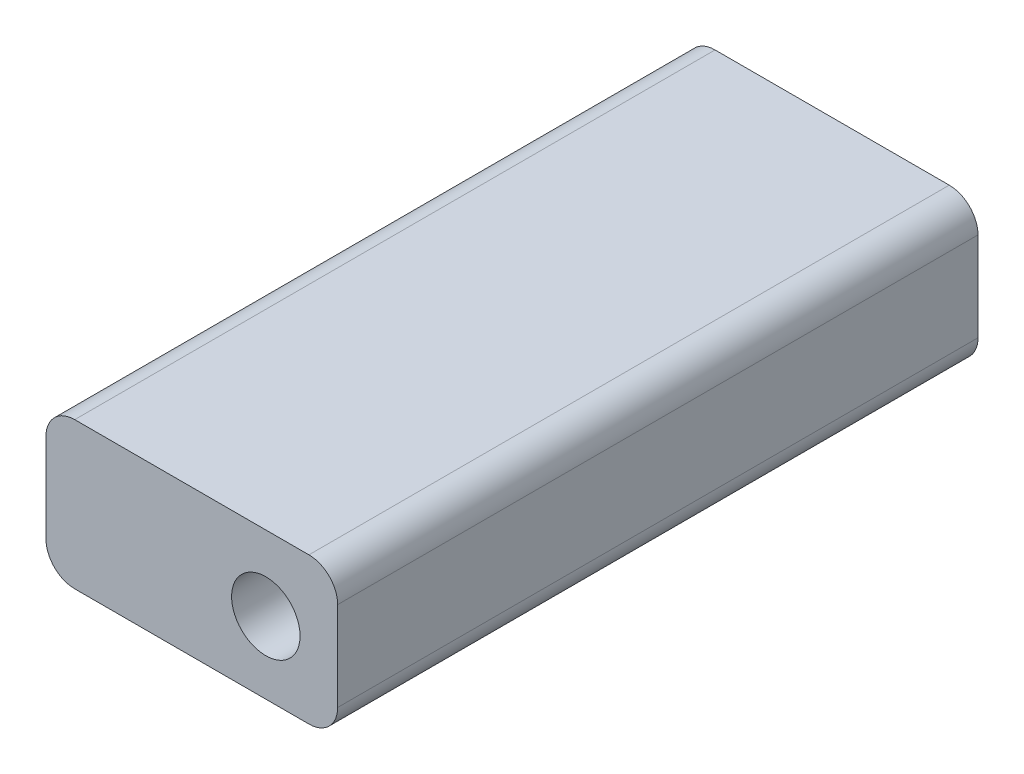
ISO-10303-21;
HEADER;
FILE_DESCRIPTION(('STEP AP214'),'2;1');
FILE_NAME('part.step','',(''),(''),'','','');
FILE_SCHEMA(('AUTOMOTIVE_DESIGN { 1 0 10303 214 1 1 1 1 }'));
ENDSEC;
DATA;
#1=APPLICATION_CONTEXT('core data for automotive mechanical design processes');
#2=APPLICATION_PROTOCOL_DEFINITION('international standard','automotive_design',2000,#1);
#3=PRODUCT_CONTEXT('',#1,'mechanical');
#4=PRODUCT('Part','Part','',(#3));
#5=PRODUCT_RELATED_PRODUCT_CATEGORY('part','',(#4));
#6=PRODUCT_DEFINITION_FORMATION('','',#4);
#7=PRODUCT_DEFINITION_CONTEXT('part definition',#1,'design');
#8=PRODUCT_DEFINITION('design','',#6,#7);
#9=PRODUCT_DEFINITION_SHAPE('','',#8);
#10=(LENGTH_UNIT() NAMED_UNIT(*) SI_UNIT(.MILLI.,.METRE.));
#11=(NAMED_UNIT(*) PLANE_ANGLE_UNIT() SI_UNIT($,.RADIAN.));
#12=(NAMED_UNIT(*) SI_UNIT($,.STERADIAN.) SOLID_ANGLE_UNIT());
#13=UNCERTAINTY_MEASURE_WITH_UNIT(LENGTH_MEASURE(1.E-05),#10,'distance_accuracy_value','');
#14=(GEOMETRIC_REPRESENTATION_CONTEXT(3) GLOBAL_UNCERTAINTY_ASSIGNED_CONTEXT((#13)) GLOBAL_UNIT_ASSIGNED_CONTEXT((#10,
#11,#12)) REPRESENTATION_CONTEXT('',''));
#15=CARTESIAN_POINT('',(0.,0.,0.));
#16=DIRECTION('',(0.,0.,1.));
#17=DIRECTION('',(1.,0.,0.));
#18=AXIS2_PLACEMENT_3D('',#15,#16,#17);
#19=CARTESIAN_POINT('',(0.,0.,56.59882));
#20=DIRECTION('',(0.,0.,1.));
#21=DIRECTION('',(1.,0.,0.));
#22=AXIS2_PLACEMENT_3D('',#19,#20,#21);
#23=PLANE('',#22);
#24=DIRECTION('',(-1.,0.,0.));
#25=VECTOR('',#24,1.);
#26=CARTESIAN_POINT('',(-19.4300000020002,91.526,56.59882));
#27=LINE('',#26,#25);
#28=CARTESIAN_POINT('',(3.80999999999999,91.526,56.59882));
#29=VERTEX_POINT('',#28);
#30=CARTESIAN_POINT('',(-16.8900000020002,91.526,56.59882));
#31=VERTEX_POINT('',#30);
#32=EDGE_CURVE('E140',#29,#31,#27,.T.);
#33=ORIENTED_EDGE('',*,*,#32,.T.);
#34=CARTESIAN_POINT('',(-16.8900000020002,88.986,56.59882));
#35=DIRECTION('',(0.,0.,1.));
#36=DIRECTION('',(1.,0.,0.));
#37=AXIS2_PLACEMENT_3D('',#34,#35,#36);
#38=CIRCLE('',#37,2.54);
#39=CARTESIAN_POINT('',(-19.4300000020002,88.986,56.59882));
#40=VERTEX_POINT('',#39);
#41=EDGE_CURVE('E159',#31,#40,#38,.T.);
#42=ORIENTED_EDGE('',*,*,#41,.T.);
#43=DIRECTION('',(0.,-1.,0.));
#44=VECTOR('',#43,1.);
#45=CARTESIAN_POINT('',(-19.4300000020002,91.526,56.59882));
#46=LINE('',#45,#44);
#47=CARTESIAN_POINT('',(-19.4300000020002,81.1119734157718,56.59882));
#48=VERTEX_POINT('',#47);
#49=EDGE_CURVE('E123',#40,#48,#46,.T.);
#50=ORIENTED_EDGE('',*,*,#49,.T.);
#51=CARTESIAN_POINT('',(-16.8900000020002,81.1119734157718,56.59882));
#52=DIRECTION('',(0.,0.,1.));
#53=DIRECTION('',(1.,0.,0.));
#54=AXIS2_PLACEMENT_3D('',#51,#52,#53);
#55=CIRCLE('',#54,2.54);
#56=CARTESIAN_POINT('',(-16.8900000020002,78.5719734157718,56.59882));
#57=VERTEX_POINT('',#56);
#58=EDGE_CURVE('E154',#48,#57,#55,.T.);
#59=ORIENTED_EDGE('',*,*,#58,.T.);
#60=DIRECTION('',(1.,0.,0.));
#61=VECTOR('',#60,1.);
#62=CARTESIAN_POINT('',(-19.4300000020002,78.5719734157718,56.59882));
#63=LINE('',#62,#61);
#64=CARTESIAN_POINT('',(3.80999999999999,78.5719734157718,56.59882));
#65=VERTEX_POINT('',#64);
#66=EDGE_CURVE('E170',#57,#65,#63,.T.);
#67=ORIENTED_EDGE('',*,*,#66,.T.);
#68=CARTESIAN_POINT('',(3.81,81.1119734157718,56.59882));
#69=DIRECTION('',(0.,0.,1.));
#70=DIRECTION('',(1.,0.,0.));
#71=AXIS2_PLACEMENT_3D('',#68,#69,#70);
#72=CIRCLE('',#71,2.54);
#73=CARTESIAN_POINT('',(6.35,81.1119734157718,56.59882));
#74=VERTEX_POINT('',#73);
#75=EDGE_CURVE('E59',#65,#74,#72,.T.);
#76=ORIENTED_EDGE('',*,*,#75,.T.);
#77=DIRECTION('',(0.,1.,0.));
#78=VECTOR('',#77,1.);
#79=CARTESIAN_POINT('',(6.35,91.526,56.59882));
#80=LINE('',#79,#78);
#81=CARTESIAN_POINT('',(6.35,88.986,56.59882));
#82=VERTEX_POINT('',#81);
#83=EDGE_CURVE('E178',#74,#82,#80,.T.);
#84=ORIENTED_EDGE('',*,*,#83,.T.);
#85=CARTESIAN_POINT('',(3.81,88.986,56.59882));
#86=DIRECTION('',(0.,0.,1.));
#87=DIRECTION('',(1.,0.,0.));
#88=AXIS2_PLACEMENT_3D('',#85,#86,#87);
#89=CIRCLE('',#88,2.54);
#90=EDGE_CURVE('E157',#82,#29,#89,.T.);
#91=ORIENTED_EDGE('',*,*,#90,.T.);
#92=EDGE_LOOP('',(#33,#42,#50,#59,#67,#76,#84,#91));
#93=FACE_BOUND('',#92,.T.);
#94=CARTESIAN_POINT('',(0.,84.9219734157718,56.59882));
#95=DIRECTION('',(0.,0.,1.));
#96=DIRECTION('',(1.,0.,0.));
#97=AXIS2_PLACEMENT_3D('',#94,#95,#96);
#98=CIRCLE('',#97,3.025);
#99=CARTESIAN_POINT('',(3.025,84.9219734157718,56.59882));
#100=VERTEX_POINT('',#99);
#101=EDGE_CURVE('E131',#100,#100,#98,.T.);
#102=ORIENTED_EDGE('',*,*,#101,.F.);
#103=EDGE_LOOP('',(#102));
#104=FACE_BOUND('',#103,.T.);
#105=ADVANCED_FACE('F37',(#93,#104),#23,.T.);
#106=CARTESIAN_POINT('',(0.,0.,0.));
#107=DIRECTION('',(0.,0.,1.));
#108=DIRECTION('',(1.,0.,0.));
#109=AXIS2_PLACEMENT_3D('',#106,#107,#108);
#110=PLANE('',#109);
#111=DIRECTION('',(0.,-1.,0.));
#112=VECTOR('',#111,1.);
#113=CARTESIAN_POINT('',(-19.4300000020002,91.526,0.));
#114=LINE('',#113,#112);
#115=CARTESIAN_POINT('',(-19.4300000020002,88.986,0.));
#116=VERTEX_POINT('',#115);
#117=CARTESIAN_POINT('',(-19.4300000020002,81.1119734157718,0.));
#118=VERTEX_POINT('',#117);
#119=EDGE_CURVE('E120',#116,#118,#114,.T.);
#120=ORIENTED_EDGE('',*,*,#119,.F.);
#121=CARTESIAN_POINT('',(-16.8900000020002,88.986,0.));
#122=DIRECTION('',(0.,0.,1.));
#123=DIRECTION('',(1.,0.,0.));
#124=AXIS2_PLACEMENT_3D('',#121,#122,#123);
#125=CIRCLE('',#124,2.54);
#126=CARTESIAN_POINT('',(-16.8900000020002,91.526,0.));
#127=VERTEX_POINT('',#126);
#128=EDGE_CURVE('E103',#116,#127,#125,.F.);
#129=ORIENTED_EDGE('',*,*,#128,.T.);
#130=DIRECTION('',(-1.,0.,0.));
#131=VECTOR('',#130,1.);
#132=CARTESIAN_POINT('',(-19.4300000020002,91.526,0.));
#133=LINE('',#132,#131);
#134=CARTESIAN_POINT('',(3.80999999999999,91.526,0.));
#135=VERTEX_POINT('',#134);
#136=EDGE_CURVE('E144',#135,#127,#133,.T.);
#137=ORIENTED_EDGE('',*,*,#136,.F.);
#138=CARTESIAN_POINT('',(3.81,88.986,0.));
#139=DIRECTION('',(0.,0.,1.));
#140=DIRECTION('',(1.,0.,0.));
#141=AXIS2_PLACEMENT_3D('',#138,#139,#140);
#142=CIRCLE('',#141,2.54);
#143=CARTESIAN_POINT('',(6.35,88.986,0.));
#144=VERTEX_POINT('',#143);
#145=EDGE_CURVE('E114',#135,#144,#142,.F.);
#146=ORIENTED_EDGE('',*,*,#145,.T.);
#147=DIRECTION('',(0.,1.,0.));
#148=VECTOR('',#147,1.);
#149=CARTESIAN_POINT('',(6.35,91.526,0.));
#150=LINE('',#149,#148);
#151=CARTESIAN_POINT('',(6.35,81.1119734157718,0.));
#152=VERTEX_POINT('',#151);
#153=EDGE_CURVE('E134',#152,#144,#150,.T.);
#154=ORIENTED_EDGE('',*,*,#153,.F.);
#155=CARTESIAN_POINT('',(3.81,81.1119734157718,0.));
#156=DIRECTION('',(0.,0.,1.));
#157=DIRECTION('',(1.,0.,0.));
#158=AXIS2_PLACEMENT_3D('',#155,#156,#157);
#159=CIRCLE('',#158,2.54);
#160=CARTESIAN_POINT('',(3.80999999999999,78.5719734157718,0.));
#161=VERTEX_POINT('',#160);
#162=EDGE_CURVE('E148',#152,#161,#159,.F.);
#163=ORIENTED_EDGE('',*,*,#162,.T.);
#164=DIRECTION('',(1.,0.,0.));
#165=VECTOR('',#164,1.);
#166=CARTESIAN_POINT('',(-19.4300000020002,78.5719734157718,0.));
#167=LINE('',#166,#165);
#168=CARTESIAN_POINT('',(-16.8900000020002,78.5719734157718,0.));
#169=VERTEX_POINT('',#168);
#170=EDGE_CURVE('E130',#169,#161,#167,.T.);
#171=ORIENTED_EDGE('',*,*,#170,.F.);
#172=CARTESIAN_POINT('',(-16.8900000020002,81.1119734157718,0.));
#173=DIRECTION('',(0.,0.,1.));
#174=DIRECTION('',(1.,0.,0.));
#175=AXIS2_PLACEMENT_3D('',#172,#173,#174);
#176=CIRCLE('',#175,2.54);
#177=EDGE_CURVE('E124',#169,#118,#176,.F.);
#178=ORIENTED_EDGE('',*,*,#177,.T.);
#179=EDGE_LOOP('',(#120,#129,#137,#146,#154,#163,#171,#178));
#180=FACE_BOUND('',#179,.T.);
#181=CARTESIAN_POINT('',(0.,84.9219734157718,0.));
#182=DIRECTION('',(0.,0.,1.));
#183=DIRECTION('',(1.,0.,0.));
#184=AXIS2_PLACEMENT_3D('',#181,#182,#183);
#185=CIRCLE('',#184,3.025);
#186=CARTESIAN_POINT('',(3.025,84.9219734157718,0.));
#187=VERTEX_POINT('',#186);
#188=EDGE_CURVE('E137',#187,#187,#185,.T.);
#189=ORIENTED_EDGE('',*,*,#188,.T.);
#190=EDGE_LOOP('',(#189));
#191=FACE_BOUND('',#190,.T.);
#192=ADVANCED_FACE('F127',(#180,#191),#110,.F.);
#193=CARTESIAN_POINT('',(-19.4300000020002,91.526,56.59882));
#194=DIRECTION('',(1.,0.,0.));
#195=DIRECTION('',(0.,0.,-1.));
#196=AXIS2_PLACEMENT_3D('',#193,#194,#195);
#197=PLANE('',#196);
#198=ORIENTED_EDGE('',*,*,#49,.F.);
#199=DIRECTION('',(0.,0.,-1.));
#200=VECTOR('',#199,1.);
#201=CARTESIAN_POINT('',(-19.4300000020002,88.986,56.59882));
#202=LINE('',#201,#200);
#203=EDGE_CURVE('E107',#40,#116,#202,.T.);
#204=ORIENTED_EDGE('',*,*,#203,.T.);
#205=ORIENTED_EDGE('',*,*,#119,.T.);
#206=DIRECTION('',(0.,0.,-1.));
#207=VECTOR('',#206,1.);
#208=CARTESIAN_POINT('',(-19.4300000020002,81.1119734157718,56.59882));
#209=LINE('',#208,#207);
#210=EDGE_CURVE('E125',#118,#48,#209,.F.);
#211=ORIENTED_EDGE('',*,*,#210,.T.);
#212=EDGE_LOOP('',(#198,#204,#205,#211));
#213=FACE_BOUND('',#212,.T.);
#214=ADVANCED_FACE('F119',(#213),#197,.F.);
#215=CARTESIAN_POINT('',(-19.4300000020002,78.5719734157718,56.59882));
#216=DIRECTION('',(0.,1.,0.));
#217=DIRECTION('',(0.,0.,1.));
#218=AXIS2_PLACEMENT_3D('',#215,#216,#217);
#219=PLANE('',#218);
#220=ORIENTED_EDGE('',*,*,#170,.T.);
#221=DIRECTION('',(0.,0.,-1.));
#222=VECTOR('',#221,1.);
#223=CARTESIAN_POINT('',(3.81,78.5719734157718,56.59882));
#224=LINE('',#223,#222);
#225=EDGE_CURVE('E11',#161,#65,#224,.F.);
#226=ORIENTED_EDGE('',*,*,#225,.T.);
#227=ORIENTED_EDGE('',*,*,#66,.F.);
#228=DIRECTION('',(0.,0.,-1.));
#229=VECTOR('',#228,1.);
#230=CARTESIAN_POINT('',(-16.8900000020002,78.5719734157718,56.59882));
#231=LINE('',#230,#229);
#232=EDGE_CURVE('E45',#57,#169,#231,.T.);
#233=ORIENTED_EDGE('',*,*,#232,.T.);
#234=EDGE_LOOP('',(#220,#226,#227,#233));
#235=FACE_BOUND('',#234,.T.);
#236=ADVANCED_FACE('F168',(#235),#219,.F.);
#237=CARTESIAN_POINT('',(6.35,91.526,56.59882));
#238=DIRECTION('',(-1.,0.,0.));
#239=DIRECTION('',(0.,0.,1.));
#240=AXIS2_PLACEMENT_3D('',#237,#238,#239);
#241=PLANE('',#240);
#242=ORIENTED_EDGE('',*,*,#153,.T.);
#243=DIRECTION('',(0.,0.,-1.));
#244=VECTOR('',#243,1.);
#245=CARTESIAN_POINT('',(6.35,88.986,56.59882));
#246=LINE('',#245,#244);
#247=EDGE_CURVE('E52',#144,#82,#246,.F.);
#248=ORIENTED_EDGE('',*,*,#247,.T.);
#249=ORIENTED_EDGE('',*,*,#83,.F.);
#250=DIRECTION('',(0.,0.,-1.));
#251=VECTOR('',#250,1.);
#252=CARTESIAN_POINT('',(6.35,81.1119734157718,56.59882));
#253=LINE('',#252,#251);
#254=EDGE_CURVE('E161',#74,#152,#253,.T.);
#255=ORIENTED_EDGE('',*,*,#254,.T.);
#256=EDGE_LOOP('',(#242,#248,#249,#255));
#257=FACE_BOUND('',#256,.T.);
#258=ADVANCED_FACE('F177',(#257),#241,.F.);
#259=CARTESIAN_POINT('',(-19.4300000020002,91.526,56.59882));
#260=DIRECTION('',(0.,-1.,0.));
#261=DIRECTION('',(0.,0.,-1.));
#262=AXIS2_PLACEMENT_3D('',#259,#260,#261);
#263=PLANE('',#262);
#264=ORIENTED_EDGE('',*,*,#136,.T.);
#265=DIRECTION('',(0.,0.,-1.));
#266=VECTOR('',#265,1.);
#267=CARTESIAN_POINT('',(-16.8900000020002,91.526,56.59882));
#268=LINE('',#267,#266);
#269=EDGE_CURVE('E108',#127,#31,#268,.F.);
#270=ORIENTED_EDGE('',*,*,#269,.T.);
#271=ORIENTED_EDGE('',*,*,#32,.F.);
#272=DIRECTION('',(0.,0.,-1.));
#273=VECTOR('',#272,1.);
#274=CARTESIAN_POINT('',(3.81,91.526,56.59882));
#275=LINE('',#274,#273);
#276=EDGE_CURVE('E113',#29,#135,#275,.T.);
#277=ORIENTED_EDGE('',*,*,#276,.T.);
#278=EDGE_LOOP('',(#264,#270,#271,#277));
#279=FACE_BOUND('',#278,.T.);
#280=ADVANCED_FACE('F189',(#279),#263,.F.);
#281=CARTESIAN_POINT('',(0.,84.9219734157718,56.59882));
#282=DIRECTION('',(0.,0.,-1.));
#283=DIRECTION('',(-1.,0.,0.));
#284=AXIS2_PLACEMENT_3D('',#281,#282,#283);
#285=CYLINDRICAL_SURFACE('',#284,3.025);
#286=ORIENTED_EDGE('',*,*,#101,.T.);
#287=EDGE_LOOP('',(#286));
#288=FACE_BOUND('',#287,.T.);
#289=ORIENTED_EDGE('',*,*,#188,.F.);
#290=EDGE_LOOP('',(#289));
#291=FACE_BOUND('',#290,.T.);
#292=ADVANCED_FACE('F187',(#288,#291),#285,.F.);
#293=CARTESIAN_POINT('',(-16.8900000020002,88.986,56.59882));
#294=DIRECTION('',(0.,0.,-1.));
#295=DIRECTION('',(-1.,0.,0.));
#296=AXIS2_PLACEMENT_3D('',#293,#294,#295);
#297=CYLINDRICAL_SURFACE('',#296,2.54);
#298=ORIENTED_EDGE('',*,*,#41,.F.);
#299=ORIENTED_EDGE('',*,*,#269,.F.);
#300=ORIENTED_EDGE('',*,*,#128,.F.);
#301=ORIENTED_EDGE('',*,*,#203,.F.);
#302=EDGE_LOOP('',(#298,#299,#300,#301));
#303=FACE_BOUND('',#302,.T.);
#304=ADVANCED_FACE('F106',(#303),#297,.T.);
#305=CARTESIAN_POINT('',(3.81,88.986,56.59882));
#306=DIRECTION('',(0.,0.,-1.));
#307=DIRECTION('',(-1.,0.,0.));
#308=AXIS2_PLACEMENT_3D('',#305,#306,#307);
#309=CYLINDRICAL_SURFACE('',#308,2.54);
#310=ORIENTED_EDGE('',*,*,#90,.F.);
#311=ORIENTED_EDGE('',*,*,#247,.F.);
#312=ORIENTED_EDGE('',*,*,#145,.F.);
#313=ORIENTED_EDGE('',*,*,#276,.F.);
#314=EDGE_LOOP('',(#310,#311,#312,#313));
#315=FACE_BOUND('',#314,.T.);
#316=ADVANCED_FACE('F196',(#315),#309,.T.);
#317=CARTESIAN_POINT('',(3.81,81.1119734157718,56.59882));
#318=DIRECTION('',(0.,0.,-1.));
#319=DIRECTION('',(-1.,0.,0.));
#320=AXIS2_PLACEMENT_3D('',#317,#318,#319);
#321=CYLINDRICAL_SURFACE('',#320,2.54);
#322=ORIENTED_EDGE('',*,*,#75,.F.);
#323=ORIENTED_EDGE('',*,*,#225,.F.);
#324=ORIENTED_EDGE('',*,*,#162,.F.);
#325=ORIENTED_EDGE('',*,*,#254,.F.);
#326=EDGE_LOOP('',(#322,#323,#324,#325));
#327=FACE_BOUND('',#326,.T.);
#328=ADVANCED_FACE('F176',(#327),#321,.T.);
#329=CARTESIAN_POINT('',(-16.8900000020002,81.1119734157718,56.59882));
#330=DIRECTION('',(0.,0.,-1.));
#331=DIRECTION('',(-1.,0.,0.));
#332=AXIS2_PLACEMENT_3D('',#329,#330,#331);
#333=CYLINDRICAL_SURFACE('',#332,2.54);
#334=ORIENTED_EDGE('',*,*,#58,.F.);
#335=ORIENTED_EDGE('',*,*,#210,.F.);
#336=ORIENTED_EDGE('',*,*,#177,.F.);
#337=ORIENTED_EDGE('',*,*,#232,.F.);
#338=EDGE_LOOP('',(#334,#335,#336,#337));
#339=FACE_BOUND('',#338,.T.);
#340=ADVANCED_FACE('F39',(#339),#333,.T.);
#341=CLOSED_SHELL('',(#105,#192,#214,#236,#258,#280,#292,#304,#316,#328,#340));
#342=MANIFOLD_SOLID_BREP('B2',#341);
#343=ADVANCED_BREP_SHAPE_REPRESENTATION('',(#18,#342),#14);
#344=SHAPE_DEFINITION_REPRESENTATION(#9,#343);
ENDSEC;
END-ISO-10303-21;
